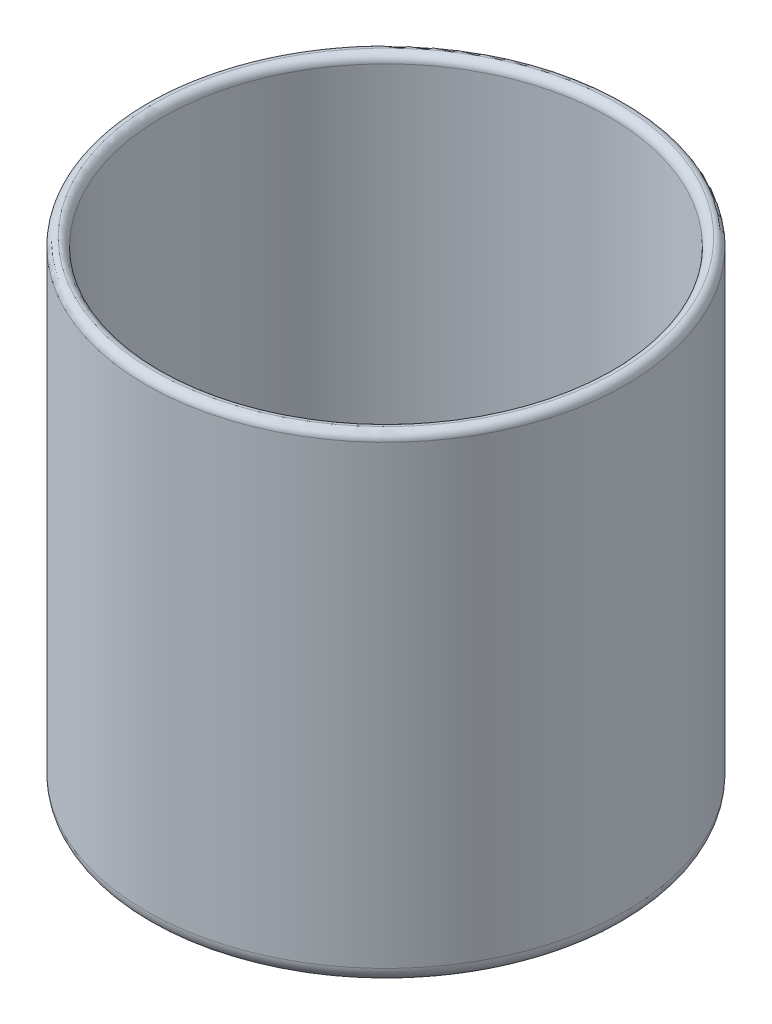
ISO-10303-21;
HEADER;
FILE_DESCRIPTION(('STEP AP214'),'2;1');
FILE_NAME('part.step','',(''),(''),'','','');
FILE_SCHEMA(('AUTOMOTIVE_DESIGN { 1 0 10303 214 1 1 1 1 }'));
ENDSEC;
DATA;
#1=APPLICATION_CONTEXT('core data for automotive mechanical design processes');
#2=APPLICATION_PROTOCOL_DEFINITION('international standard','automotive_design',2000,#1);
#3=PRODUCT_CONTEXT('',#1,'mechanical');
#4=PRODUCT('Part','Part','',(#3));
#5=PRODUCT_RELATED_PRODUCT_CATEGORY('part','',(#4));
#6=PRODUCT_DEFINITION_FORMATION('','',#4);
#7=PRODUCT_DEFINITION_CONTEXT('part definition',#1,'design');
#8=PRODUCT_DEFINITION('design','',#6,#7);
#9=PRODUCT_DEFINITION_SHAPE('','',#8);
#10=(LENGTH_UNIT() NAMED_UNIT(*) SI_UNIT(.MILLI.,.METRE.));
#11=(NAMED_UNIT(*) PLANE_ANGLE_UNIT() SI_UNIT($,.RADIAN.));
#12=(NAMED_UNIT(*) SI_UNIT($,.STERADIAN.) SOLID_ANGLE_UNIT());
#13=UNCERTAINTY_MEASURE_WITH_UNIT(LENGTH_MEASURE(1.E-05),#10,'distance_accuracy_value','');
#14=(GEOMETRIC_REPRESENTATION_CONTEXT(3) GLOBAL_UNCERTAINTY_ASSIGNED_CONTEXT((#13)) GLOBAL_UNIT_ASSIGNED_CONTEXT((#10,
#11,#12)) REPRESENTATION_CONTEXT('',''));
#15=CARTESIAN_POINT('',(0.,0.,0.));
#16=DIRECTION('',(0.,0.,1.));
#17=DIRECTION('',(1.,0.,0.));
#18=AXIS2_PLACEMENT_3D('',#15,#16,#17);
#19=CARTESIAN_POINT('',(0.,60.,0.));
#20=DIRECTION('',(0.,-1.,0.));
#21=DIRECTION('',(0.,0.,-1.));
#22=AXIS2_PLACEMENT_3D('',#19,#20,#21);
#23=CYLINDRICAL_SURFACE('',#22,30.);
#24=CARTESIAN_POINT('',(0.,59.,0.));
#25=DIRECTION('',(0.,1.,0.));
#26=DIRECTION('',(0.,0.,1.));
#27=AXIS2_PLACEMENT_3D('',#24,#25,#26);
#28=CIRCLE('',#27,30.);
#29=CARTESIAN_POINT('',(0.,59.,30.));
#30=VERTEX_POINT('',#29);
#31=EDGE_CURVE('E49',#30,#30,#28,.F.);
#32=ORIENTED_EDGE('',*,*,#31,.T.);
#33=EDGE_LOOP('',(#32));
#34=FACE_BOUND('',#33,.T.);
#35=CARTESIAN_POINT('',(0.,2.,0.));
#36=DIRECTION('',(0.,1.,0.));
#37=DIRECTION('',(0.,0.,1.));
#38=AXIS2_PLACEMENT_3D('',#35,#36,#37);
#39=CIRCLE('',#38,30.);
#40=CARTESIAN_POINT('',(0.,2.,30.));
#41=VERTEX_POINT('',#40);
#42=EDGE_CURVE('E137',#41,#41,#39,.T.);
#43=ORIENTED_EDGE('',*,*,#42,.T.);
#44=EDGE_LOOP('',(#43));
#45=FACE_BOUND('',#44,.T.);
#46=ADVANCED_FACE('F41',(#34,#45),#23,.T.);
#47=CARTESIAN_POINT('',(0.,0.,0.));
#48=DIRECTION('',(0.,1.,0.));
#49=DIRECTION('',(0.,0.,1.));
#50=AXIS2_PLACEMENT_3D('',#47,#48,#49);
#51=PLANE('',#50);
#52=CARTESIAN_POINT('',(0.,0.,10.));
#53=DIRECTION('',(0.,1.,0.));
#54=DIRECTION('',(0.,0.,1.));
#55=AXIS2_PLACEMENT_3D('',#52,#53,#54);
#56=CIRCLE('',#55,2.5);
#57=CARTESIAN_POINT('',(0.,0.,12.5));
#58=VERTEX_POINT('',#57);
#59=EDGE_CURVE('E73',#58,#58,#56,.T.);
#60=ORIENTED_EDGE('',*,*,#59,.T.);
#61=EDGE_LOOP('',(#60));
#62=FACE_BOUND('',#61,.T.);
#63=CARTESIAN_POINT('',(-10.,0.,0.));
#64=DIRECTION('',(0.,1.,0.));
#65=DIRECTION('',(0.,0.,1.));
#66=AXIS2_PLACEMENT_3D('',#63,#64,#65);
#67=CIRCLE('',#66,2.5);
#68=CARTESIAN_POINT('',(-10.,0.,2.5));
#69=VERTEX_POINT('',#68);
#70=EDGE_CURVE('E77',#69,#69,#67,.T.);
#71=ORIENTED_EDGE('',*,*,#70,.T.);
#72=EDGE_LOOP('',(#71));
#73=FACE_BOUND('',#72,.T.);
#74=CARTESIAN_POINT('',(0.,0.,-10.));
#75=DIRECTION('',(0.,1.,0.));
#76=DIRECTION('',(0.,0.,1.));
#77=AXIS2_PLACEMENT_3D('',#74,#75,#76);
#78=CIRCLE('',#77,2.5);
#79=CARTESIAN_POINT('',(0.,0.,-7.5));
#80=VERTEX_POINT('',#79);
#81=EDGE_CURVE('E81',#80,#80,#78,.T.);
#82=ORIENTED_EDGE('',*,*,#81,.T.);
#83=EDGE_LOOP('',(#82));
#84=FACE_BOUND('',#83,.T.);
#85=CARTESIAN_POINT('',(10.,0.,0.));
#86=DIRECTION('',(0.,1.,0.));
#87=DIRECTION('',(0.,0.,1.));
#88=AXIS2_PLACEMENT_3D('',#85,#86,#87);
#89=CIRCLE('',#88,2.5);
#90=CARTESIAN_POINT('',(10.,0.,2.5));
#91=VERTEX_POINT('',#90);
#92=EDGE_CURVE('E85',#91,#91,#89,.T.);
#93=ORIENTED_EDGE('',*,*,#92,.T.);
#94=EDGE_LOOP('',(#93));
#95=FACE_BOUND('',#94,.T.);
#96=CARTESIAN_POINT('',(0.,0.,0.));
#97=DIRECTION('',(0.,1.,0.));
#98=DIRECTION('',(0.,0.,1.));
#99=AXIS2_PLACEMENT_3D('',#96,#97,#98);
#100=CIRCLE('',#99,28.);
#101=CARTESIAN_POINT('',(0.,0.,28.));
#102=VERTEX_POINT('',#101);
#103=EDGE_CURVE('E133',#102,#102,#100,.F.);
#104=ORIENTED_EDGE('',*,*,#103,.T.);
#105=EDGE_LOOP('',(#104));
#106=FACE_BOUND('',#105,.T.);
#107=ADVANCED_FACE('F162',(#62,#73,#84,#95,#106),#51,.F.);
#108=CARTESIAN_POINT('',(0.,5.,0.));
#109=DIRECTION('',(0.,1.,0.));
#110=DIRECTION('',(0.,0.,1.));
#111=AXIS2_PLACEMENT_3D('',#108,#109,#110);
#112=CYLINDRICAL_SURFACE('',#111,28.);
#113=CARTESIAN_POINT('',(0.,59.,0.));
#114=DIRECTION('',(0.,1.,0.));
#115=DIRECTION('',(0.,0.,1.));
#116=AXIS2_PLACEMENT_3D('',#113,#114,#115);
#117=CIRCLE('',#116,28.);
#118=CARTESIAN_POINT('',(0.,59.,28.));
#119=VERTEX_POINT('',#118);
#120=EDGE_CURVE('E10',#119,#119,#117,.T.);
#121=ORIENTED_EDGE('',*,*,#120,.T.);
#122=EDGE_LOOP('',(#121));
#123=FACE_BOUND('',#122,.T.);
#124=CARTESIAN_POINT('',(0.,7.,0.));
#125=DIRECTION('',(0.,1.,0.));
#126=DIRECTION('',(0.,0.,1.));
#127=AXIS2_PLACEMENT_3D('',#124,#125,#126);
#128=CIRCLE('',#127,28.);
#129=CARTESIAN_POINT('',(0.,7.,28.));
#130=VERTEX_POINT('',#129);
#131=EDGE_CURVE('E125',#130,#130,#128,.F.);
#132=ORIENTED_EDGE('',*,*,#131,.T.);
#133=EDGE_LOOP('',(#132));
#134=FACE_BOUND('',#133,.T.);
#135=ADVANCED_FACE('F166',(#123,#134),#112,.F.);
#136=CARTESIAN_POINT('',(0.,5.,0.));
#137=DIRECTION('',(0.,1.,0.));
#138=DIRECTION('',(0.,0.,1.));
#139=AXIS2_PLACEMENT_3D('',#136,#137,#138);
#140=PLANE('',#139);
#141=CARTESIAN_POINT('',(-10.,5.,0.));
#142=DIRECTION('',(0.,1.,0.));
#143=DIRECTION('',(0.,0.,1.));
#144=AXIS2_PLACEMENT_3D('',#141,#142,#143);
#145=CIRCLE('',#144,3.5);
#146=CARTESIAN_POINT('',(-10.,5.,3.5));
#147=VERTEX_POINT('',#146);
#148=EDGE_CURVE('E109',#147,#147,#145,.F.);
#149=ORIENTED_EDGE('',*,*,#148,.T.);
#150=EDGE_LOOP('',(#149));
#151=FACE_BOUND('',#150,.T.);
#152=CARTESIAN_POINT('',(0.,5.,10.));
#153=DIRECTION('',(0.,1.,0.));
#154=DIRECTION('',(0.,0.,1.));
#155=AXIS2_PLACEMENT_3D('',#152,#153,#154);
#156=CIRCLE('',#155,3.5);
#157=CARTESIAN_POINT('',(0.,5.,13.5));
#158=VERTEX_POINT('',#157);
#159=EDGE_CURVE('E113',#158,#158,#156,.F.);
#160=ORIENTED_EDGE('',*,*,#159,.T.);
#161=EDGE_LOOP('',(#160));
#162=FACE_BOUND('',#161,.T.);
#163=CARTESIAN_POINT('',(0.,5.,-10.));
#164=DIRECTION('',(0.,1.,0.));
#165=DIRECTION('',(0.,0.,1.));
#166=AXIS2_PLACEMENT_3D('',#163,#164,#165);
#167=CIRCLE('',#166,3.5);
#168=CARTESIAN_POINT('',(0.,5.,-6.5));
#169=VERTEX_POINT('',#168);
#170=EDGE_CURVE('E117',#169,#169,#167,.F.);
#171=ORIENTED_EDGE('',*,*,#170,.T.);
#172=EDGE_LOOP('',(#171));
#173=FACE_BOUND('',#172,.T.);
#174=CARTESIAN_POINT('',(10.,5.,0.));
#175=DIRECTION('',(0.,1.,0.));
#176=DIRECTION('',(0.,0.,1.));
#177=AXIS2_PLACEMENT_3D('',#174,#175,#176);
#178=CIRCLE('',#177,3.5);
#179=CARTESIAN_POINT('',(10.,5.,3.5));
#180=VERTEX_POINT('',#179);
#181=EDGE_CURVE('E121',#180,#180,#178,.F.);
#182=ORIENTED_EDGE('',*,*,#181,.T.);
#183=EDGE_LOOP('',(#182));
#184=FACE_BOUND('',#183,.T.);
#185=CARTESIAN_POINT('',(0.,5.,0.));
#186=DIRECTION('',(0.,1.,0.));
#187=DIRECTION('',(0.,0.,1.));
#188=AXIS2_PLACEMENT_3D('',#185,#186,#187);
#189=CIRCLE('',#188,26.);
#190=CARTESIAN_POINT('',(0.,5.,26.));
#191=VERTEX_POINT('',#190);
#192=EDGE_CURVE('E129',#191,#191,#189,.T.);
#193=ORIENTED_EDGE('',*,*,#192,.T.);
#194=EDGE_LOOP('',(#193));
#195=FACE_BOUND('',#194,.T.);
#196=ADVANCED_FACE('F172',(#151,#162,#173,#184,#195),#140,.T.);
#197=CARTESIAN_POINT('',(-10.,5.,0.));
#198=DIRECTION('',(0.,-1.,0.));
#199=DIRECTION('',(0.,0.,-1.));
#200=AXIS2_PLACEMENT_3D('',#197,#198,#199);
#201=CYLINDRICAL_SURFACE('',#200,1.5);
#202=CARTESIAN_POINT('',(-10.,1.,0.));
#203=DIRECTION('',(0.,1.,0.));
#204=DIRECTION('',(0.,0.,1.));
#205=AXIS2_PLACEMENT_3D('',#202,#203,#204);
#206=CIRCLE('',#205,1.5);
#207=CARTESIAN_POINT('',(-10.,1.,1.5));
#208=VERTEX_POINT('',#207);
#209=EDGE_CURVE('E69',#208,#208,#206,.F.);
#210=ORIENTED_EDGE('',*,*,#209,.T.);
#211=EDGE_LOOP('',(#210));
#212=FACE_BOUND('',#211,.T.);
#213=CARTESIAN_POINT('',(-10.,3.,0.));
#214=DIRECTION('',(0.,1.,0.));
#215=DIRECTION('',(0.,0.,1.));
#216=AXIS2_PLACEMENT_3D('',#213,#214,#215);
#217=CIRCLE('',#216,1.5);
#218=CARTESIAN_POINT('',(-10.,3.,1.5));
#219=VERTEX_POINT('',#218);
#220=EDGE_CURVE('E105',#219,#219,#217,.T.);
#221=ORIENTED_EDGE('',*,*,#220,.T.);
#222=EDGE_LOOP('',(#221));
#223=FACE_BOUND('',#222,.T.);
#224=ADVANCED_FACE('F175',(#212,#223),#201,.F.);
#225=CARTESIAN_POINT('',(10.,5.,0.));
#226=DIRECTION('',(0.,-1.,0.));
#227=DIRECTION('',(0.,0.,-1.));
#228=AXIS2_PLACEMENT_3D('',#225,#226,#227);
#229=CYLINDRICAL_SURFACE('',#228,1.5);
#230=CARTESIAN_POINT('',(10.,1.,0.));
#231=DIRECTION('',(0.,1.,0.));
#232=DIRECTION('',(0.,0.,1.));
#233=AXIS2_PLACEMENT_3D('',#230,#231,#232);
#234=CIRCLE('',#233,1.5);
#235=CARTESIAN_POINT('',(10.,1.,1.5));
#236=VERTEX_POINT('',#235);
#237=EDGE_CURVE('E59',#236,#236,#234,.F.);
#238=ORIENTED_EDGE('',*,*,#237,.T.);
#239=EDGE_LOOP('',(#238));
#240=FACE_BOUND('',#239,.T.);
#241=CARTESIAN_POINT('',(10.,3.,0.));
#242=DIRECTION('',(0.,1.,0.));
#243=DIRECTION('',(0.,0.,1.));
#244=AXIS2_PLACEMENT_3D('',#241,#242,#243);
#245=CIRCLE('',#244,1.5);
#246=CARTESIAN_POINT('',(10.,3.,1.5));
#247=VERTEX_POINT('',#246);
#248=EDGE_CURVE('E93',#247,#247,#245,.T.);
#249=ORIENTED_EDGE('',*,*,#248,.T.);
#250=EDGE_LOOP('',(#249));
#251=FACE_BOUND('',#250,.T.);
#252=ADVANCED_FACE('F179',(#240,#251),#229,.F.);
#253=CARTESIAN_POINT('',(0.,5.,-10.));
#254=DIRECTION('',(0.,-1.,0.));
#255=DIRECTION('',(0.,0.,-1.));
#256=AXIS2_PLACEMENT_3D('',#253,#254,#255);
#257=CYLINDRICAL_SURFACE('',#256,1.5);
#258=CARTESIAN_POINT('',(0.,1.,-10.));
#259=DIRECTION('',(0.,1.,0.));
#260=DIRECTION('',(0.,0.,1.));
#261=AXIS2_PLACEMENT_3D('',#258,#259,#260);
#262=CIRCLE('',#261,1.5);
#263=CARTESIAN_POINT('',(0.,1.,-8.5));
#264=VERTEX_POINT('',#263);
#265=EDGE_CURVE('E65',#264,#264,#262,.F.);
#266=ORIENTED_EDGE('',*,*,#265,.T.);
#267=EDGE_LOOP('',(#266));
#268=FACE_BOUND('',#267,.T.);
#269=CARTESIAN_POINT('',(0.,3.,-10.));
#270=DIRECTION('',(0.,1.,0.));
#271=DIRECTION('',(0.,0.,1.));
#272=AXIS2_PLACEMENT_3D('',#269,#270,#271);
#273=CIRCLE('',#272,1.5);
#274=CARTESIAN_POINT('',(0.,3.,-8.5));
#275=VERTEX_POINT('',#274);
#276=EDGE_CURVE('E97',#275,#275,#273,.T.);
#277=ORIENTED_EDGE('',*,*,#276,.T.);
#278=EDGE_LOOP('',(#277));
#279=FACE_BOUND('',#278,.T.);
#280=ADVANCED_FACE('F156',(#268,#279),#257,.F.);
#281=CARTESIAN_POINT('',(0.,5.,10.));
#282=DIRECTION('',(0.,-1.,0.));
#283=DIRECTION('',(0.,0.,-1.));
#284=AXIS2_PLACEMENT_3D('',#281,#282,#283);
#285=CYLINDRICAL_SURFACE('',#284,1.5);
#286=CARTESIAN_POINT('',(0.,1.,10.));
#287=DIRECTION('',(0.,1.,0.));
#288=DIRECTION('',(0.,0.,1.));
#289=AXIS2_PLACEMENT_3D('',#286,#287,#288);
#290=CIRCLE('',#289,1.5);
#291=CARTESIAN_POINT('',(0.,1.,11.5));
#292=VERTEX_POINT('',#291);
#293=EDGE_CURVE('E89',#292,#292,#290,.F.);
#294=ORIENTED_EDGE('',*,*,#293,.T.);
#295=EDGE_LOOP('',(#294));
#296=FACE_BOUND('',#295,.T.);
#297=CARTESIAN_POINT('',(0.,3.,10.));
#298=DIRECTION('',(0.,1.,0.));
#299=DIRECTION('',(0.,0.,1.));
#300=AXIS2_PLACEMENT_3D('',#297,#298,#299);
#301=CIRCLE('',#300,1.5);
#302=CARTESIAN_POINT('',(0.,3.,11.5));
#303=VERTEX_POINT('',#302);
#304=EDGE_CURVE('E101',#303,#303,#301,.T.);
#305=ORIENTED_EDGE('',*,*,#304,.T.);
#306=EDGE_LOOP('',(#305));
#307=FACE_BOUND('',#306,.T.);
#308=ADVANCED_FACE('F146',(#296,#307),#285,.F.);
#309=CARTESIAN_POINT('',(0.,2.,0.));
#310=DIRECTION('',(0.,1.,0.));
#311=DIRECTION('',(0.,0.,1.));
#312=AXIS2_PLACEMENT_3D('',#309,#310,#311);
#313=TOROIDAL_SURFACE('',#312,28.,2.);
#314=ORIENTED_EDGE('',*,*,#103,.F.);
#315=EDGE_LOOP('',(#314));
#316=FACE_BOUND('',#315,.T.);
#317=ORIENTED_EDGE('',*,*,#42,.F.);
#318=EDGE_LOOP('',(#317));
#319=FACE_BOUND('',#318,.T.);
#320=ADVANCED_FACE('F143',(#316,#319),#313,.T.);
#321=CARTESIAN_POINT('',(0.,7.,0.));
#322=DIRECTION('',(0.,1.,0.));
#323=DIRECTION('',(0.,0.,1.));
#324=AXIS2_PLACEMENT_3D('',#321,#322,#323);
#325=TOROIDAL_SURFACE('',#324,26.,2.);
#326=ORIENTED_EDGE('',*,*,#131,.F.);
#327=EDGE_LOOP('',(#326));
#328=FACE_BOUND('',#327,.T.);
#329=ORIENTED_EDGE('',*,*,#192,.F.);
#330=EDGE_LOOP('',(#329));
#331=FACE_BOUND('',#330,.T.);
#332=ADVANCED_FACE('F145',(#328,#331),#325,.F.);
#333=CARTESIAN_POINT('',(-10.,3.,0.));
#334=DIRECTION('',(0.,1.,0.));
#335=DIRECTION('',(0.,0.,1.));
#336=AXIS2_PLACEMENT_3D('',#333,#334,#335);
#337=TOROIDAL_SURFACE('',#336,3.5,2.);
#338=ORIENTED_EDGE('',*,*,#220,.F.);
#339=EDGE_LOOP('',(#338));
#340=FACE_BOUND('',#339,.T.);
#341=ORIENTED_EDGE('',*,*,#148,.F.);
#342=EDGE_LOOP('',(#341));
#343=FACE_BOUND('',#342,.T.);
#344=ADVANCED_FACE('F153',(#340,#343),#337,.T.);
#345=CARTESIAN_POINT('',(0.,3.,10.));
#346=DIRECTION('',(0.,1.,0.));
#347=DIRECTION('',(0.,0.,1.));
#348=AXIS2_PLACEMENT_3D('',#345,#346,#347);
#349=TOROIDAL_SURFACE('',#348,3.5,2.);
#350=ORIENTED_EDGE('',*,*,#304,.F.);
#351=EDGE_LOOP('',(#350));
#352=FACE_BOUND('',#351,.T.);
#353=ORIENTED_EDGE('',*,*,#159,.F.);
#354=EDGE_LOOP('',(#353));
#355=FACE_BOUND('',#354,.T.);
#356=ADVANCED_FACE('F196',(#352,#355),#349,.T.);
#357=CARTESIAN_POINT('',(0.,3.,-10.));
#358=DIRECTION('',(0.,1.,0.));
#359=DIRECTION('',(0.,0.,1.));
#360=AXIS2_PLACEMENT_3D('',#357,#358,#359);
#361=TOROIDAL_SURFACE('',#360,3.5,2.);
#362=ORIENTED_EDGE('',*,*,#276,.F.);
#363=EDGE_LOOP('',(#362));
#364=FACE_BOUND('',#363,.T.);
#365=ORIENTED_EDGE('',*,*,#170,.F.);
#366=EDGE_LOOP('',(#365));
#367=FACE_BOUND('',#366,.T.);
#368=ADVANCED_FACE('F192',(#364,#367),#361,.T.);
#369=CARTESIAN_POINT('',(10.,3.,0.));
#370=DIRECTION('',(0.,1.,0.));
#371=DIRECTION('',(0.,0.,1.));
#372=AXIS2_PLACEMENT_3D('',#369,#370,#371);
#373=TOROIDAL_SURFACE('',#372,3.5,2.);
#374=ORIENTED_EDGE('',*,*,#248,.F.);
#375=EDGE_LOOP('',(#374));
#376=FACE_BOUND('',#375,.T.);
#377=ORIENTED_EDGE('',*,*,#181,.F.);
#378=EDGE_LOOP('',(#377));
#379=FACE_BOUND('',#378,.T.);
#380=ADVANCED_FACE('F195',(#376,#379),#373,.T.);
#381=CARTESIAN_POINT('',(0.,1.,10.));
#382=DIRECTION('',(0.,1.,0.));
#383=DIRECTION('',(0.,0.,1.));
#384=AXIS2_PLACEMENT_3D('',#381,#382,#383);
#385=TOROIDAL_SURFACE('',#384,2.5,1.);
#386=ORIENTED_EDGE('',*,*,#59,.F.);
#387=EDGE_LOOP('',(#386));
#388=FACE_BOUND('',#387,.T.);
#389=ORIENTED_EDGE('',*,*,#293,.F.);
#390=EDGE_LOOP('',(#389));
#391=FACE_BOUND('',#390,.T.);
#392=ADVANCED_FACE('F207',(#388,#391),#385,.T.);
#393=CARTESIAN_POINT('',(-10.,1.,0.));
#394=DIRECTION('',(0.,1.,0.));
#395=DIRECTION('',(0.,0.,1.));
#396=AXIS2_PLACEMENT_3D('',#393,#394,#395);
#397=TOROIDAL_SURFACE('',#396,2.5,1.);
#398=ORIENTED_EDGE('',*,*,#70,.F.);
#399=EDGE_LOOP('',(#398));
#400=FACE_BOUND('',#399,.T.);
#401=ORIENTED_EDGE('',*,*,#209,.F.);
#402=EDGE_LOOP('',(#401));
#403=FACE_BOUND('',#402,.T.);
#404=ADVANCED_FACE('F213',(#400,#403),#397,.T.);
#405=CARTESIAN_POINT('',(0.,1.,-10.));
#406=DIRECTION('',(0.,1.,0.));
#407=DIRECTION('',(0.,0.,1.));
#408=AXIS2_PLACEMENT_3D('',#405,#406,#407);
#409=TOROIDAL_SURFACE('',#408,2.5,1.);
#410=ORIENTED_EDGE('',*,*,#81,.F.);
#411=EDGE_LOOP('',(#410));
#412=FACE_BOUND('',#411,.T.);
#413=ORIENTED_EDGE('',*,*,#265,.F.);
#414=EDGE_LOOP('',(#413));
#415=FACE_BOUND('',#414,.T.);
#416=ADVANCED_FACE('F221',(#412,#415),#409,.T.);
#417=CARTESIAN_POINT('',(10.,1.,0.));
#418=DIRECTION('',(0.,1.,0.));
#419=DIRECTION('',(0.,0.,1.));
#420=AXIS2_PLACEMENT_3D('',#417,#418,#419);
#421=TOROIDAL_SURFACE('',#420,2.5,1.);
#422=ORIENTED_EDGE('',*,*,#92,.F.);
#423=EDGE_LOOP('',(#422));
#424=FACE_BOUND('',#423,.T.);
#425=ORIENTED_EDGE('',*,*,#237,.F.);
#426=EDGE_LOOP('',(#425));
#427=FACE_BOUND('',#426,.T.);
#428=ADVANCED_FACE('F225',(#424,#427),#421,.T.);
#429=CARTESIAN_POINT('',(0.,59.,0.));
#430=DIRECTION('',(0.,1.,0.));
#431=DIRECTION('',(0.,0.,1.));
#432=AXIS2_PLACEMENT_3D('',#429,#430,#431);
#433=TOROIDAL_SURFACE('',#432,29.,1.);
#434=ORIENTED_EDGE('',*,*,#31,.F.);
#435=EDGE_LOOP('',(#434));
#436=FACE_BOUND('',#435,.T.);
#437=CARTESIAN_POINT('',(0.,60.,0.));
#438=DIRECTION('',(0.,1.,0.));
#439=DIRECTION('',(0.,0.,1.));
#440=AXIS2_PLACEMENT_3D('',#437,#438,#439);
#441=CIRCLE('',#440,29.);
#442=CARTESIAN_POINT('',(0.,60.,29.));
#443=VERTEX_POINT('',#442);
#444=EDGE_CURVE('E54',#443,#443,#441,.T.);
#445=ORIENTED_EDGE('',*,*,#444,.F.);
#446=EDGE_LOOP('',(#445));
#447=FACE_BOUND('',#446,.T.);
#448=ADVANCED_FACE('F228',(#436,#447),#433,.T.);
#449=CARTESIAN_POINT('',(0.,59.,0.));
#450=DIRECTION('',(0.,1.,0.));
#451=DIRECTION('',(0.,0.,1.));
#452=AXIS2_PLACEMENT_3D('',#449,#450,#451);
#453=TOROIDAL_SURFACE('',#452,29.,1.);
#454=ORIENTED_EDGE('',*,*,#444,.T.);
#455=EDGE_LOOP('',(#454));
#456=FACE_BOUND('',#455,.T.);
#457=ORIENTED_EDGE('',*,*,#120,.F.);
#458=EDGE_LOOP('',(#457));
#459=FACE_BOUND('',#458,.T.);
#460=ADVANCED_FACE('F43',(#456,#459),#453,.T.);
#461=CLOSED_SHELL('',(#46,#107,#135,#196,#224,#252,#280,#308,#320,#332,#344,#356,#368,#380,#392,
#404,#416,#428,#448,#460));
#462=MANIFOLD_SOLID_BREP('B2',#461);
#463=ADVANCED_BREP_SHAPE_REPRESENTATION('',(#18,#462),#14);
#464=SHAPE_DEFINITION_REPRESENTATION(#9,#463);
ENDSEC;
END-ISO-10303-21;
